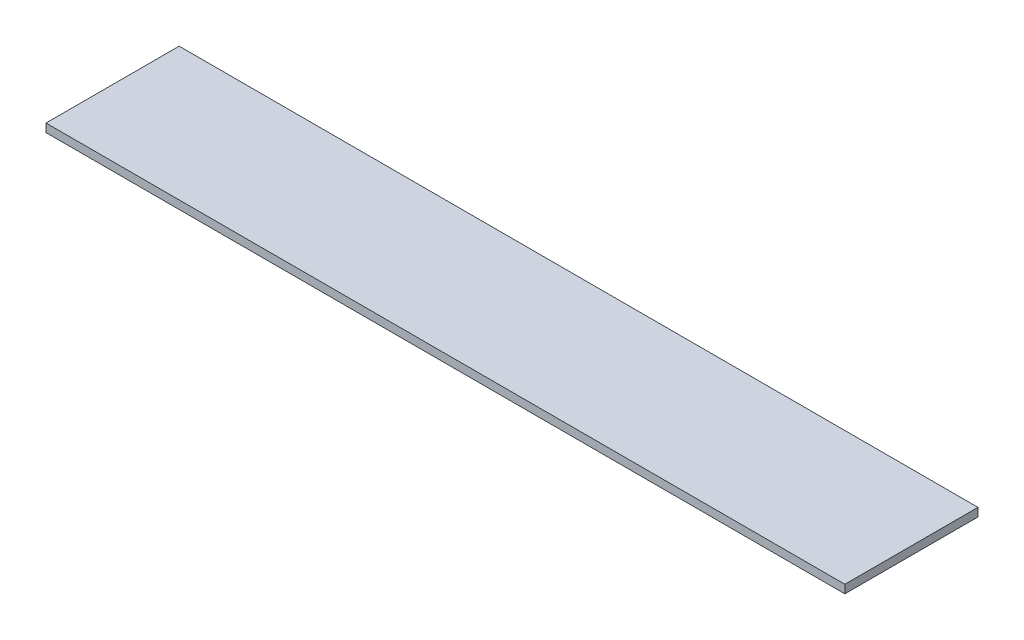
ISO-10303-21;
HEADER;
FILE_DESCRIPTION(('STEP AP214'),'2;1');
FILE_NAME('part.step','',(''),(''),'','','');
FILE_SCHEMA(('AUTOMOTIVE_DESIGN { 1 0 10303 214 1 1 1 1 }'));
ENDSEC;
DATA;
#1=APPLICATION_CONTEXT('core data for automotive mechanical design processes');
#2=APPLICATION_PROTOCOL_DEFINITION('international standard','automotive_design',2000,#1);
#3=PRODUCT_CONTEXT('',#1,'mechanical');
#4=PRODUCT('Part','Part','',(#3));
#5=PRODUCT_RELATED_PRODUCT_CATEGORY('part','',(#4));
#6=PRODUCT_DEFINITION_FORMATION('','',#4);
#7=PRODUCT_DEFINITION_CONTEXT('part definition',#1,'design');
#8=PRODUCT_DEFINITION('design','',#6,#7);
#9=PRODUCT_DEFINITION_SHAPE('','',#8);
#10=(LENGTH_UNIT() NAMED_UNIT(*) SI_UNIT(.MILLI.,.METRE.));
#11=(NAMED_UNIT(*) PLANE_ANGLE_UNIT() SI_UNIT($,.RADIAN.));
#12=(NAMED_UNIT(*) SI_UNIT($,.STERADIAN.) SOLID_ANGLE_UNIT());
#13=UNCERTAINTY_MEASURE_WITH_UNIT(LENGTH_MEASURE(1.E-05),#10,'distance_accuracy_value','');
#14=(GEOMETRIC_REPRESENTATION_CONTEXT(3) GLOBAL_UNCERTAINTY_ASSIGNED_CONTEXT((#13)) GLOBAL_UNIT_ASSIGNED_CONTEXT((#10,
#11,#12)) REPRESENTATION_CONTEXT('',''));
#15=CARTESIAN_POINT('',(0.,0.,0.));
#16=DIRECTION('',(0.,0.,1.));
#17=DIRECTION('',(1.,0.,0.));
#18=AXIS2_PLACEMENT_3D('',#15,#16,#17);
#19=CARTESIAN_POINT('',(0.,1.5875,0.));
#20=DIRECTION('',(1.,0.,0.));
#21=DIRECTION('',(0.,0.,-1.));
#22=AXIS2_PLACEMENT_3D('',#19,#20,#21);
#23=PLANE('',#22);
#24=DIRECTION('',(0.,0.,1.));
#25=VECTOR('',#24,1.);
#26=CARTESIAN_POINT('',(0.,0.,0.));
#27=LINE('',#26,#25);
#28=CARTESIAN_POINT('',(0.,0.,-25.4));
#29=VERTEX_POINT('',#28);
#30=CARTESIAN_POINT('',(0.,0.,0.));
#31=VERTEX_POINT('',#30);
#32=EDGE_CURVE('E93',#29,#31,#27,.T.);
#33=ORIENTED_EDGE('',*,*,#32,.T.);
#34=DIRECTION('',(0.,-1.,0.));
#35=VECTOR('',#34,1.);
#36=CARTESIAN_POINT('',(0.,1.5875,0.));
#37=LINE('',#36,#35);
#38=CARTESIAN_POINT('',(0.,1.5875,0.));
#39=VERTEX_POINT('',#38);
#40=EDGE_CURVE('E11',#39,#31,#37,.T.);
#41=ORIENTED_EDGE('',*,*,#40,.F.);
#42=DIRECTION('',(0.,0.,1.));
#43=VECTOR('',#42,1.);
#44=CARTESIAN_POINT('',(0.,1.5875,0.));
#45=LINE('',#44,#43);
#46=CARTESIAN_POINT('',(0.,1.5875,-25.4));
#47=VERTEX_POINT('',#46);
#48=EDGE_CURVE('E81',#47,#39,#45,.T.);
#49=ORIENTED_EDGE('',*,*,#48,.F.);
#50=DIRECTION('',(0.,-1.,0.));
#51=VECTOR('',#50,1.);
#52=CARTESIAN_POINT('',(0.,1.5875,-25.4));
#53=LINE('',#52,#51);
#54=EDGE_CURVE('E89',#47,#29,#53,.T.);
#55=ORIENTED_EDGE('',*,*,#54,.T.);
#56=EDGE_LOOP('',(#33,#41,#49,#55));
#57=FACE_BOUND('',#56,.T.);
#58=ADVANCED_FACE('F30',(#57),#23,.F.);
#59=CARTESIAN_POINT('',(0.,1.5875,0.));
#60=DIRECTION('',(0.,0.,-1.));
#61=DIRECTION('',(-1.,0.,0.));
#62=AXIS2_PLACEMENT_3D('',#59,#60,#61);
#63=PLANE('',#62);
#64=DIRECTION('',(1.,0.,0.));
#65=VECTOR('',#64,1.);
#66=CARTESIAN_POINT('',(0.,0.,0.));
#67=LINE('',#66,#65);
#68=CARTESIAN_POINT('',(152.4,0.,0.));
#69=VERTEX_POINT('',#68);
#70=EDGE_CURVE('E85',#31,#69,#67,.T.);
#71=ORIENTED_EDGE('',*,*,#70,.T.);
#72=DIRECTION('',(0.,-1.,0.));
#73=VECTOR('',#72,1.);
#74=CARTESIAN_POINT('',(152.4,1.5875,0.));
#75=LINE('',#74,#73);
#76=CARTESIAN_POINT('',(152.4,1.5875,0.));
#77=VERTEX_POINT('',#76);
#78=EDGE_CURVE('E38',#77,#69,#75,.T.);
#79=ORIENTED_EDGE('',*,*,#78,.F.);
#80=DIRECTION('',(1.,0.,0.));
#81=VECTOR('',#80,1.);
#82=CARTESIAN_POINT('',(0.,1.5875,0.));
#83=LINE('',#82,#81);
#84=EDGE_CURVE('E76',#39,#77,#83,.T.);
#85=ORIENTED_EDGE('',*,*,#84,.F.);
#86=ORIENTED_EDGE('',*,*,#40,.T.);
#87=EDGE_LOOP('',(#71,#79,#85,#86));
#88=FACE_BOUND('',#87,.T.);
#89=ADVANCED_FACE('F84',(#88),#63,.F.);
#90=CARTESIAN_POINT('',(152.4,1.5875,0.));
#91=DIRECTION('',(-1.,0.,0.));
#92=DIRECTION('',(0.,0.,1.));
#93=AXIS2_PLACEMENT_3D('',#90,#91,#92);
#94=PLANE('',#93);
#95=DIRECTION('',(0.,0.,-1.));
#96=VECTOR('',#95,1.);
#97=CARTESIAN_POINT('',(152.4,0.,0.));
#98=LINE('',#97,#96);
#99=CARTESIAN_POINT('',(152.4,0.,-25.4));
#100=VERTEX_POINT('',#99);
#101=EDGE_CURVE('E63',#69,#100,#98,.T.);
#102=ORIENTED_EDGE('',*,*,#101,.T.);
#103=DIRECTION('',(0.,-1.,0.));
#104=VECTOR('',#103,1.);
#105=CARTESIAN_POINT('',(152.4,1.5875,-25.4));
#106=LINE('',#105,#104);
#107=CARTESIAN_POINT('',(152.4,1.5875,-25.4));
#108=VERTEX_POINT('',#107);
#109=EDGE_CURVE('E86',#108,#100,#106,.T.);
#110=ORIENTED_EDGE('',*,*,#109,.F.);
#111=DIRECTION('',(0.,0.,-1.));
#112=VECTOR('',#111,1.);
#113=CARTESIAN_POINT('',(152.4,1.5875,0.));
#114=LINE('',#113,#112);
#115=EDGE_CURVE('E79',#77,#108,#114,.T.);
#116=ORIENTED_EDGE('',*,*,#115,.F.);
#117=ORIENTED_EDGE('',*,*,#78,.T.);
#118=EDGE_LOOP('',(#102,#110,#116,#117));
#119=FACE_BOUND('',#118,.T.);
#120=ADVANCED_FACE('F87',(#119),#94,.F.);
#121=CARTESIAN_POINT('',(0.,1.5875,-25.4));
#122=DIRECTION('',(0.,0.,1.));
#123=DIRECTION('',(1.,0.,0.));
#124=AXIS2_PLACEMENT_3D('',#121,#122,#123);
#125=PLANE('',#124);
#126=DIRECTION('',(-1.,0.,0.));
#127=VECTOR('',#126,1.);
#128=CARTESIAN_POINT('',(0.,0.,-25.4));
#129=LINE('',#128,#127);
#130=EDGE_CURVE('E69',#100,#29,#129,.T.);
#131=ORIENTED_EDGE('',*,*,#130,.T.);
#132=ORIENTED_EDGE('',*,*,#54,.F.);
#133=DIRECTION('',(-1.,0.,0.));
#134=VECTOR('',#133,1.);
#135=CARTESIAN_POINT('',(0.,1.5875,-25.4));
#136=LINE('',#135,#134);
#137=EDGE_CURVE('E46',#108,#47,#136,.T.);
#138=ORIENTED_EDGE('',*,*,#137,.F.);
#139=ORIENTED_EDGE('',*,*,#109,.T.);
#140=EDGE_LOOP('',(#131,#132,#138,#139));
#141=FACE_BOUND('',#140,.T.);
#142=ADVANCED_FACE('F100',(#141),#125,.F.);
#143=CARTESIAN_POINT('',(0.,1.5875,0.));
#144=DIRECTION('',(0.,-1.,0.));
#145=DIRECTION('',(0.,0.,-1.));
#146=AXIS2_PLACEMENT_3D('',#143,#144,#145);
#147=PLANE('',#146);
#148=ORIENTED_EDGE('',*,*,#48,.T.);
#149=ORIENTED_EDGE('',*,*,#84,.T.);
#150=ORIENTED_EDGE('',*,*,#115,.T.);
#151=ORIENTED_EDGE('',*,*,#137,.T.);
#152=EDGE_LOOP('',(#148,#149,#150,#151));
#153=FACE_BOUND('',#152,.T.);
#154=ADVANCED_FACE('F77',(#153),#147,.F.);
#155=CARTESIAN_POINT('',(0.,0.,0.));
#156=DIRECTION('',(0.,-1.,0.));
#157=DIRECTION('',(0.,0.,-1.));
#158=AXIS2_PLACEMENT_3D('',#155,#156,#157);
#159=PLANE('',#158);
#160=ORIENTED_EDGE('',*,*,#32,.F.);
#161=ORIENTED_EDGE('',*,*,#130,.F.);
#162=ORIENTED_EDGE('',*,*,#101,.F.);
#163=ORIENTED_EDGE('',*,*,#70,.F.);
#164=EDGE_LOOP('',(#160,#161,#162,#163));
#165=FACE_BOUND('',#164,.T.);
#166=ADVANCED_FACE('F103',(#165),#159,.T.);
#167=CLOSED_SHELL('',(#58,#89,#120,#142,#154,#166));
#168=MANIFOLD_SOLID_BREP('B2',#167);
#169=ADVANCED_BREP_SHAPE_REPRESENTATION('',(#18,#168),#14);
#170=SHAPE_DEFINITION_REPRESENTATION(#9,#169);
ENDSEC;
END-ISO-10303-21;
